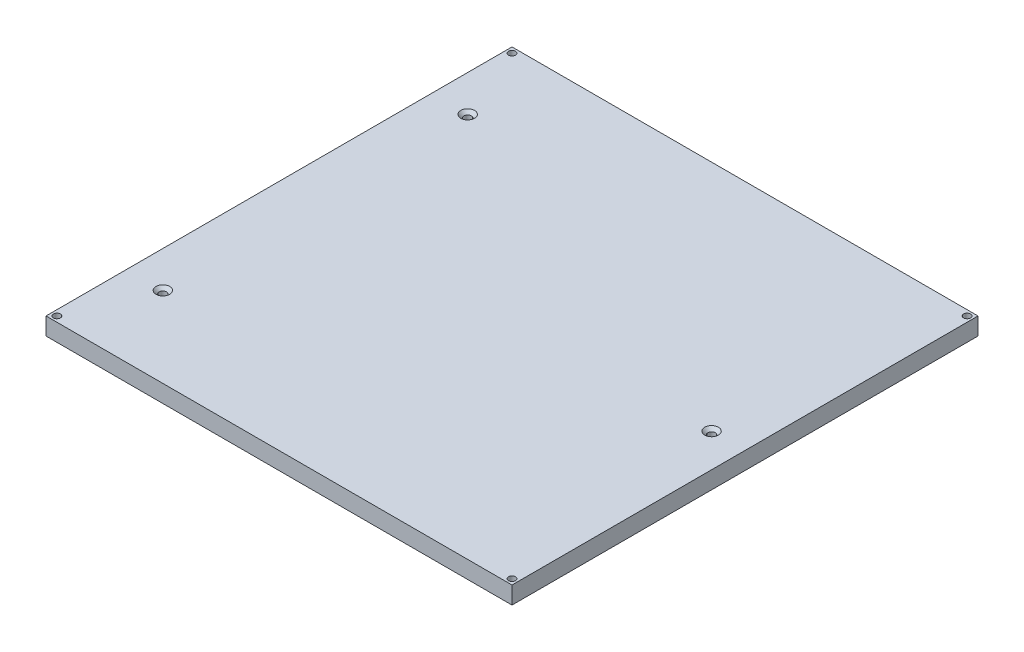
ISO-10303-21;
HEADER;
FILE_DESCRIPTION(('STEP AP214'),'2;1');
FILE_NAME('part.step','',(''),(''),'','','');
FILE_SCHEMA(('AUTOMOTIVE_DESIGN { 1 0 10303 214 1 1 1 1 }'));
ENDSEC;
DATA;
#1=APPLICATION_CONTEXT('core data for automotive mechanical design processes');
#2=APPLICATION_PROTOCOL_DEFINITION('international standard','automotive_design',2000,#1);
#3=PRODUCT_CONTEXT('',#1,'mechanical');
#4=PRODUCT('Part','Part','',(#3));
#5=PRODUCT_RELATED_PRODUCT_CATEGORY('part','',(#4));
#6=PRODUCT_DEFINITION_FORMATION('','',#4);
#7=PRODUCT_DEFINITION_CONTEXT('part definition',#1,'design');
#8=PRODUCT_DEFINITION('design','',#6,#7);
#9=PRODUCT_DEFINITION_SHAPE('','',#8);
#10=(LENGTH_UNIT() NAMED_UNIT(*) SI_UNIT(.MILLI.,.METRE.));
#11=(NAMED_UNIT(*) PLANE_ANGLE_UNIT() SI_UNIT($,.RADIAN.));
#12=(NAMED_UNIT(*) SI_UNIT($,.STERADIAN.) SOLID_ANGLE_UNIT());
#13=UNCERTAINTY_MEASURE_WITH_UNIT(LENGTH_MEASURE(1.E-05),#10,'distance_accuracy_value','');
#14=(GEOMETRIC_REPRESENTATION_CONTEXT(3) GLOBAL_UNCERTAINTY_ASSIGNED_CONTEXT((#13)) GLOBAL_UNIT_ASSIGNED_CONTEXT((#10,
#11,#12)) REPRESENTATION_CONTEXT('',''));
#15=CARTESIAN_POINT('',(0.,0.,0.));
#16=DIRECTION('',(0.,0.,1.));
#17=DIRECTION('',(1.,0.,0.));
#18=AXIS2_PLACEMENT_3D('',#15,#16,#17);
#19=CARTESIAN_POINT('',(-107.,8.,-107.));
#20=DIRECTION('',(1.,0.,0.));
#21=DIRECTION('',(0.,0.,-1.));
#22=AXIS2_PLACEMENT_3D('',#19,#20,#21);
#23=PLANE('',#22);
#24=DIRECTION('',(0.,0.,1.));
#25=VECTOR('',#24,1.);
#26=CARTESIAN_POINT('',(-107.,0.,-107.));
#27=LINE('',#26,#25);
#28=CARTESIAN_POINT('',(-107.,0.,-107.));
#29=VERTEX_POINT('',#28);
#30=CARTESIAN_POINT('',(-107.,0.,107.));
#31=VERTEX_POINT('',#30);
#32=EDGE_CURVE('E96',#29,#31,#27,.T.);
#33=ORIENTED_EDGE('',*,*,#32,.T.);
#34=DIRECTION('',(0.,-1.,0.));
#35=VECTOR('',#34,1.);
#36=CARTESIAN_POINT('',(-107.,8.,107.));
#37=LINE('',#36,#35);
#38=CARTESIAN_POINT('',(-107.,8.,107.));
#39=VERTEX_POINT('',#38);
#40=EDGE_CURVE('E11',#39,#31,#37,.T.);
#41=ORIENTED_EDGE('',*,*,#40,.F.);
#42=DIRECTION('',(0.,0.,1.));
#43=VECTOR('',#42,1.);
#44=CARTESIAN_POINT('',(-107.,8.,-107.));
#45=LINE('',#44,#43);
#46=CARTESIAN_POINT('',(-107.,8.,-107.));
#47=VERTEX_POINT('',#46);
#48=EDGE_CURVE('E84',#47,#39,#45,.T.);
#49=ORIENTED_EDGE('',*,*,#48,.F.);
#50=DIRECTION('',(0.,-1.,0.));
#51=VECTOR('',#50,1.);
#52=CARTESIAN_POINT('',(-107.,8.,-107.));
#53=LINE('',#52,#51);
#54=EDGE_CURVE('E92',#47,#29,#53,.T.);
#55=ORIENTED_EDGE('',*,*,#54,.T.);
#56=EDGE_LOOP('',(#33,#41,#49,#55));
#57=FACE_BOUND('',#56,.T.);
#58=ADVANCED_FACE('F33',(#57),#23,.F.);
#59=CARTESIAN_POINT('',(-107.,8.,107.));
#60=DIRECTION('',(0.,0.,-1.));
#61=DIRECTION('',(-1.,0.,0.));
#62=AXIS2_PLACEMENT_3D('',#59,#60,#61);
#63=PLANE('',#62);
#64=DIRECTION('',(1.,0.,0.));
#65=VECTOR('',#64,1.);
#66=CARTESIAN_POINT('',(-107.,0.,107.));
#67=LINE('',#66,#65);
#68=CARTESIAN_POINT('',(107.,0.,107.));
#69=VERTEX_POINT('',#68);
#70=EDGE_CURVE('E88',#31,#69,#67,.T.);
#71=ORIENTED_EDGE('',*,*,#70,.T.);
#72=DIRECTION('',(0.,-1.,0.));
#73=VECTOR('',#72,1.);
#74=CARTESIAN_POINT('',(107.,8.,107.));
#75=LINE('',#74,#73);
#76=CARTESIAN_POINT('',(107.,8.,107.));
#77=VERTEX_POINT('',#76);
#78=EDGE_CURVE('E41',#77,#69,#75,.T.);
#79=ORIENTED_EDGE('',*,*,#78,.F.);
#80=DIRECTION('',(1.,0.,0.));
#81=VECTOR('',#80,1.);
#82=CARTESIAN_POINT('',(-107.,8.,107.));
#83=LINE('',#82,#81);
#84=EDGE_CURVE('E79',#39,#77,#83,.T.);
#85=ORIENTED_EDGE('',*,*,#84,.F.);
#86=ORIENTED_EDGE('',*,*,#40,.T.);
#87=EDGE_LOOP('',(#71,#79,#85,#86));
#88=FACE_BOUND('',#87,.T.);
#89=ADVANCED_FACE('F87',(#88),#63,.F.);
#90=CARTESIAN_POINT('',(107.,8.,-107.));
#91=DIRECTION('',(-1.,0.,0.));
#92=DIRECTION('',(0.,0.,1.));
#93=AXIS2_PLACEMENT_3D('',#90,#91,#92);
#94=PLANE('',#93);
#95=DIRECTION('',(0.,0.,-1.));
#96=VECTOR('',#95,1.);
#97=CARTESIAN_POINT('',(107.,0.,-107.));
#98=LINE('',#97,#96);
#99=CARTESIAN_POINT('',(107.,0.,-107.));
#100=VERTEX_POINT('',#99);
#101=EDGE_CURVE('E66',#69,#100,#98,.T.);
#102=ORIENTED_EDGE('',*,*,#101,.T.);
#103=DIRECTION('',(0.,-1.,0.));
#104=VECTOR('',#103,1.);
#105=CARTESIAN_POINT('',(107.,8.,-107.));
#106=LINE('',#105,#104);
#107=CARTESIAN_POINT('',(107.,8.,-107.));
#108=VERTEX_POINT('',#107);
#109=EDGE_CURVE('E89',#108,#100,#106,.T.);
#110=ORIENTED_EDGE('',*,*,#109,.F.);
#111=DIRECTION('',(0.,0.,-1.));
#112=VECTOR('',#111,1.);
#113=CARTESIAN_POINT('',(107.,8.,-107.));
#114=LINE('',#113,#112);
#115=EDGE_CURVE('E82',#77,#108,#114,.T.);
#116=ORIENTED_EDGE('',*,*,#115,.F.);
#117=ORIENTED_EDGE('',*,*,#78,.T.);
#118=EDGE_LOOP('',(#102,#110,#116,#117));
#119=FACE_BOUND('',#118,.T.);
#120=ADVANCED_FACE('F90',(#119),#94,.F.);
#121=CARTESIAN_POINT('',(-107.,8.,-107.));
#122=DIRECTION('',(0.,0.,1.));
#123=DIRECTION('',(1.,0.,0.));
#124=AXIS2_PLACEMENT_3D('',#121,#122,#123);
#125=PLANE('',#124);
#126=DIRECTION('',(-1.,0.,0.));
#127=VECTOR('',#126,1.);
#128=CARTESIAN_POINT('',(-107.,0.,-107.));
#129=LINE('',#128,#127);
#130=EDGE_CURVE('E72',#100,#29,#129,.T.);
#131=ORIENTED_EDGE('',*,*,#130,.T.);
#132=ORIENTED_EDGE('',*,*,#54,.F.);
#133=DIRECTION('',(-1.,0.,0.));
#134=VECTOR('',#133,1.);
#135=CARTESIAN_POINT('',(-107.,8.,-107.));
#136=LINE('',#135,#134);
#137=EDGE_CURVE('E49',#108,#47,#136,.T.);
#138=ORIENTED_EDGE('',*,*,#137,.F.);
#139=ORIENTED_EDGE('',*,*,#109,.T.);
#140=EDGE_LOOP('',(#131,#132,#138,#139));
#141=FACE_BOUND('',#140,.T.);
#142=ADVANCED_FACE('F104',(#141),#125,.F.);
#143=CARTESIAN_POINT('',(0.,8.,0.));
#144=DIRECTION('',(0.,1.,0.));
#145=DIRECTION('',(0.,0.,1.));
#146=AXIS2_PLACEMENT_3D('',#143,#144,#145);
#147=PLANE('',#146);
#148=CARTESIAN_POINT('',(-90.3456842106107,8.,-70.));
#149=DIRECTION('',(0.,1.,0.));
#150=DIRECTION('',(0.,0.,1.));
#151=AXIS2_PLACEMENT_3D('',#148,#149,#150);
#152=CIRCLE('',#151,3.15);
#153=CARTESIAN_POINT('',(-90.3456842106107,8.,-66.85));
#154=VERTEX_POINT('',#153);
#155=EDGE_CURVE('E157',#154,#154,#152,.T.);
#156=ORIENTED_EDGE('',*,*,#155,.F.);
#157=EDGE_LOOP('',(#156));
#158=FACE_BOUND('',#157,.T.);
#159=CARTESIAN_POINT('',(-90.3456842106107,8.,70.));
#160=DIRECTION('',(0.,1.,0.));
#161=DIRECTION('',(0.,0.,1.));
#162=AXIS2_PLACEMENT_3D('',#159,#160,#161);
#163=CIRCLE('',#162,3.15);
#164=CARTESIAN_POINT('',(-90.3456842106107,8.,73.15));
#165=VERTEX_POINT('',#164);
#166=EDGE_CURVE('E148',#165,#165,#163,.T.);
#167=ORIENTED_EDGE('',*,*,#166,.F.);
#168=EDGE_LOOP('',(#167));
#169=FACE_BOUND('',#168,.T.);
#170=CARTESIAN_POINT('',(91.6543157895794,8.,0.));
#171=DIRECTION('',(0.,1.,0.));
#172=DIRECTION('',(0.,0.,1.));
#173=AXIS2_PLACEMENT_3D('',#170,#171,#172);
#174=CIRCLE('',#173,3.15);
#175=CARTESIAN_POINT('',(91.6543157895794,8.,3.15000000000004));
#176=VERTEX_POINT('',#175);
#177=EDGE_CURVE('E139',#176,#176,#174,.T.);
#178=ORIENTED_EDGE('',*,*,#177,.F.);
#179=EDGE_LOOP('',(#178));
#180=FACE_BOUND('',#179,.T.);
#181=CARTESIAN_POINT('',(-104.5,8.,104.5));
#182=DIRECTION('',(0.,1.,0.));
#183=DIRECTION('',(0.,0.,1.));
#184=AXIS2_PLACEMENT_3D('',#181,#182,#183);
#185=CIRCLE('',#184,1.6);
#186=CARTESIAN_POINT('',(-104.5,8.,106.1));
#187=VERTEX_POINT('',#186);
#188=EDGE_CURVE('E130',#187,#187,#185,.T.);
#189=ORIENTED_EDGE('',*,*,#188,.F.);
#190=EDGE_LOOP('',(#189));
#191=FACE_BOUND('',#190,.T.);
#192=CARTESIAN_POINT('',(-104.5,8.,-104.5));
#193=DIRECTION('',(0.,1.,0.));
#194=DIRECTION('',(0.,0.,1.));
#195=AXIS2_PLACEMENT_3D('',#192,#193,#194);
#196=CIRCLE('',#195,1.6);
#197=CARTESIAN_POINT('',(-104.5,8.,-102.9));
#198=VERTEX_POINT('',#197);
#199=EDGE_CURVE('E124',#198,#198,#196,.T.);
#200=ORIENTED_EDGE('',*,*,#199,.F.);
#201=EDGE_LOOP('',(#200));
#202=FACE_BOUND('',#201,.T.);
#203=CARTESIAN_POINT('',(104.5,8.,-104.5));
#204=DIRECTION('',(0.,1.,0.));
#205=DIRECTION('',(0.,0.,1.));
#206=AXIS2_PLACEMENT_3D('',#203,#204,#205);
#207=CIRCLE('',#206,1.6);
#208=CARTESIAN_POINT('',(104.5,8.,-102.9));
#209=VERTEX_POINT('',#208);
#210=EDGE_CURVE('E118',#209,#209,#207,.T.);
#211=ORIENTED_EDGE('',*,*,#210,.F.);
#212=EDGE_LOOP('',(#211));
#213=FACE_BOUND('',#212,.T.);
#214=CARTESIAN_POINT('',(104.5,8.,104.5));
#215=DIRECTION('',(0.,1.,0.));
#216=DIRECTION('',(0.,0.,1.));
#217=AXIS2_PLACEMENT_3D('',#214,#215,#216);
#218=CIRCLE('',#217,1.6);
#219=CARTESIAN_POINT('',(104.5,8.,106.1));
#220=VERTEX_POINT('',#219);
#221=EDGE_CURVE('E112',#220,#220,#218,.T.);
#222=ORIENTED_EDGE('',*,*,#221,.F.);
#223=EDGE_LOOP('',(#222));
#224=FACE_BOUND('',#223,.T.);
#225=ORIENTED_EDGE('',*,*,#48,.T.);
#226=ORIENTED_EDGE('',*,*,#84,.T.);
#227=ORIENTED_EDGE('',*,*,#115,.T.);
#228=ORIENTED_EDGE('',*,*,#137,.T.);
#229=EDGE_LOOP('',(#225,#226,#227,#228));
#230=FACE_BOUND('',#229,.T.);
#231=ADVANCED_FACE('F80',(#158,#169,#180,#191,#202,#213,#224,#230),#147,.T.);
#232=CARTESIAN_POINT('',(0.,0.,0.));
#233=DIRECTION('',(0.,1.,0.));
#234=DIRECTION('',(0.,0.,1.));
#235=AXIS2_PLACEMENT_3D('',#232,#233,#234);
#236=PLANE('',#235);
#237=CARTESIAN_POINT('',(-90.3456842106107,0.,-70.));
#238=DIRECTION('',(0.,1.,0.));
#239=DIRECTION('',(0.,0.,1.));
#240=AXIS2_PLACEMENT_3D('',#237,#238,#239);
#241=CIRCLE('',#240,1.69999999999999);
#242=CARTESIAN_POINT('',(-90.3456842106107,0.,-68.3));
#243=VERTEX_POINT('',#242);
#244=EDGE_CURVE('E151',#243,#243,#241,.T.);
#245=ORIENTED_EDGE('',*,*,#244,.T.);
#246=EDGE_LOOP('',(#245));
#247=FACE_BOUND('',#246,.T.);
#248=CARTESIAN_POINT('',(-90.3456842106107,0.,70.));
#249=DIRECTION('',(0.,1.,0.));
#250=DIRECTION('',(0.,0.,1.));
#251=AXIS2_PLACEMENT_3D('',#248,#249,#250);
#252=CIRCLE('',#251,1.69999999999999);
#253=CARTESIAN_POINT('',(-90.3456842106107,0.,71.7));
#254=VERTEX_POINT('',#253);
#255=EDGE_CURVE('E142',#254,#254,#252,.T.);
#256=ORIENTED_EDGE('',*,*,#255,.T.);
#257=EDGE_LOOP('',(#256));
#258=FACE_BOUND('',#257,.T.);
#259=CARTESIAN_POINT('',(91.6543157895794,0.,0.));
#260=DIRECTION('',(0.,1.,0.));
#261=DIRECTION('',(0.,0.,1.));
#262=AXIS2_PLACEMENT_3D('',#259,#260,#261);
#263=CIRCLE('',#262,1.69999999999999);
#264=CARTESIAN_POINT('',(91.6543157895794,0.,1.70000000000003));
#265=VERTEX_POINT('',#264);
#266=EDGE_CURVE('E133',#265,#265,#263,.T.);
#267=ORIENTED_EDGE('',*,*,#266,.T.);
#268=EDGE_LOOP('',(#267));
#269=FACE_BOUND('',#268,.T.);
#270=CARTESIAN_POINT('',(-104.5,0.,104.5));
#271=DIRECTION('',(0.,1.,0.));
#272=DIRECTION('',(0.,0.,1.));
#273=AXIS2_PLACEMENT_3D('',#270,#271,#272);
#274=CIRCLE('',#273,1.6);
#275=CARTESIAN_POINT('',(-104.5,0.,106.1));
#276=VERTEX_POINT('',#275);
#277=EDGE_CURVE('E127',#276,#276,#274,.T.);
#278=ORIENTED_EDGE('',*,*,#277,.T.);
#279=EDGE_LOOP('',(#278));
#280=FACE_BOUND('',#279,.T.);
#281=CARTESIAN_POINT('',(-104.5,0.,-104.5));
#282=DIRECTION('',(0.,1.,0.));
#283=DIRECTION('',(0.,0.,1.));
#284=AXIS2_PLACEMENT_3D('',#281,#282,#283);
#285=CIRCLE('',#284,1.6);
#286=CARTESIAN_POINT('',(-104.5,0.,-102.9));
#287=VERTEX_POINT('',#286);
#288=EDGE_CURVE('E121',#287,#287,#285,.T.);
#289=ORIENTED_EDGE('',*,*,#288,.T.);
#290=EDGE_LOOP('',(#289));
#291=FACE_BOUND('',#290,.T.);
#292=CARTESIAN_POINT('',(104.5,0.,-104.5));
#293=DIRECTION('',(0.,1.,0.));
#294=DIRECTION('',(0.,0.,1.));
#295=AXIS2_PLACEMENT_3D('',#292,#293,#294);
#296=CIRCLE('',#295,1.6);
#297=CARTESIAN_POINT('',(104.5,0.,-102.9));
#298=VERTEX_POINT('',#297);
#299=EDGE_CURVE('E115',#298,#298,#296,.T.);
#300=ORIENTED_EDGE('',*,*,#299,.T.);
#301=EDGE_LOOP('',(#300));
#302=FACE_BOUND('',#301,.T.);
#303=CARTESIAN_POINT('',(104.5,0.,104.5));
#304=DIRECTION('',(0.,1.,0.));
#305=DIRECTION('',(0.,0.,1.));
#306=AXIS2_PLACEMENT_3D('',#303,#304,#305);
#307=CIRCLE('',#306,1.6);
#308=CARTESIAN_POINT('',(104.5,0.,106.1));
#309=VERTEX_POINT('',#308);
#310=EDGE_CURVE('E99',#309,#309,#307,.T.);
#311=ORIENTED_EDGE('',*,*,#310,.T.);
#312=EDGE_LOOP('',(#311));
#313=FACE_BOUND('',#312,.T.);
#314=ORIENTED_EDGE('',*,*,#32,.F.);
#315=ORIENTED_EDGE('',*,*,#130,.F.);
#316=ORIENTED_EDGE('',*,*,#101,.F.);
#317=ORIENTED_EDGE('',*,*,#70,.F.);
#318=EDGE_LOOP('',(#314,#315,#316,#317));
#319=FACE_BOUND('',#318,.T.);
#320=ADVANCED_FACE('F107',(#247,#258,#269,#280,#291,#302,#313,#319),#236,.F.);
#321=CARTESIAN_POINT('',(104.5,8.,104.5));
#322=DIRECTION('',(0.,1.,0.));
#323=DIRECTION('',(0.,0.,1.));
#324=AXIS2_PLACEMENT_3D('',#321,#322,#323);
#325=CYLINDRICAL_SURFACE('',#324,1.6);
#326=ORIENTED_EDGE('',*,*,#310,.F.);
#327=EDGE_LOOP('',(#326));
#328=FACE_BOUND('',#327,.T.);
#329=ORIENTED_EDGE('',*,*,#221,.T.);
#330=EDGE_LOOP('',(#329));
#331=FACE_BOUND('',#330,.T.);
#332=ADVANCED_FACE('F178',(#328,#331),#325,.F.);
#333=CARTESIAN_POINT('',(104.5,8.,-104.5));
#334=DIRECTION('',(0.,1.,0.));
#335=DIRECTION('',(0.,0.,1.));
#336=AXIS2_PLACEMENT_3D('',#333,#334,#335);
#337=CYLINDRICAL_SURFACE('',#336,1.6);
#338=ORIENTED_EDGE('',*,*,#299,.F.);
#339=EDGE_LOOP('',(#338));
#340=FACE_BOUND('',#339,.T.);
#341=ORIENTED_EDGE('',*,*,#210,.T.);
#342=EDGE_LOOP('',(#341));
#343=FACE_BOUND('',#342,.T.);
#344=ADVANCED_FACE('F180',(#340,#343),#337,.F.);
#345=CARTESIAN_POINT('',(-104.5,8.,-104.5));
#346=DIRECTION('',(0.,1.,0.));
#347=DIRECTION('',(0.,0.,1.));
#348=AXIS2_PLACEMENT_3D('',#345,#346,#347);
#349=CYLINDRICAL_SURFACE('',#348,1.6);
#350=ORIENTED_EDGE('',*,*,#288,.F.);
#351=EDGE_LOOP('',(#350));
#352=FACE_BOUND('',#351,.T.);
#353=ORIENTED_EDGE('',*,*,#199,.T.);
#354=EDGE_LOOP('',(#353));
#355=FACE_BOUND('',#354,.T.);
#356=ADVANCED_FACE('F187',(#352,#355),#349,.F.);
#357=CARTESIAN_POINT('',(-104.5,8.,104.5));
#358=DIRECTION('',(0.,1.,0.));
#359=DIRECTION('',(0.,0.,1.));
#360=AXIS2_PLACEMENT_3D('',#357,#358,#359);
#361=CYLINDRICAL_SURFACE('',#360,1.6);
#362=ORIENTED_EDGE('',*,*,#277,.F.);
#363=EDGE_LOOP('',(#362));
#364=FACE_BOUND('',#363,.T.);
#365=ORIENTED_EDGE('',*,*,#188,.T.);
#366=EDGE_LOOP('',(#365));
#367=FACE_BOUND('',#366,.T.);
#368=ADVANCED_FACE('F228',(#364,#367),#361,.F.);
#369=CARTESIAN_POINT('',(91.6543157895794,8.,0.));
#370=DIRECTION('',(0.,1.,0.));
#371=DIRECTION('',(0.,0.,1.));
#372=AXIS2_PLACEMENT_3D('',#369,#370,#371);
#373=CYLINDRICAL_SURFACE('',#372,1.69999999999999);
#374=ORIENTED_EDGE('',*,*,#266,.F.);
#375=EDGE_LOOP('',(#374));
#376=FACE_BOUND('',#375,.T.);
#377=CARTESIAN_POINT('',(91.6543157895794,6.55,0.));
#378=DIRECTION('',(0.,1.,0.));
#379=DIRECTION('',(0.,0.,1.));
#380=AXIS2_PLACEMENT_3D('',#377,#378,#379);
#381=CIRCLE('',#380,1.69999999999999);
#382=CARTESIAN_POINT('',(91.6543157895794,6.55,1.70000000000003));
#383=VERTEX_POINT('',#382);
#384=EDGE_CURVE('E136',#383,#383,#381,.T.);
#385=ORIENTED_EDGE('',*,*,#384,.T.);
#386=EDGE_LOOP('',(#385));
#387=FACE_BOUND('',#386,.T.);
#388=ADVANCED_FACE('F222',(#376,#387),#373,.F.);
#389=CARTESIAN_POINT('',(91.6543157895794,8.,0.));
#390=DIRECTION('',(0.,1.,0.));
#391=DIRECTION('',(0.,0.,1.));
#392=AXIS2_PLACEMENT_3D('',#389,#390,#391);
#393=CONICAL_SURFACE('',#392,3.15,0.785398163397451);
#394=ORIENTED_EDGE('',*,*,#384,.F.);
#395=EDGE_LOOP('',(#394));
#396=FACE_BOUND('',#395,.T.);
#397=ORIENTED_EDGE('',*,*,#177,.T.);
#398=EDGE_LOOP('',(#397));
#399=FACE_BOUND('',#398,.T.);
#400=ADVANCED_FACE('F227',(#396,#399),#393,.F.);
#401=CARTESIAN_POINT('',(-90.3456842106107,8.,70.));
#402=DIRECTION('',(0.,1.,0.));
#403=DIRECTION('',(0.,0.,1.));
#404=AXIS2_PLACEMENT_3D('',#401,#402,#403);
#405=CYLINDRICAL_SURFACE('',#404,1.69999999999999);
#406=ORIENTED_EDGE('',*,*,#255,.F.);
#407=EDGE_LOOP('',(#406));
#408=FACE_BOUND('',#407,.T.);
#409=CARTESIAN_POINT('',(-90.3456842106107,6.55,70.));
#410=DIRECTION('',(0.,1.,0.));
#411=DIRECTION('',(0.,0.,1.));
#412=AXIS2_PLACEMENT_3D('',#409,#410,#411);
#413=CIRCLE('',#412,1.69999999999999);
#414=CARTESIAN_POINT('',(-90.3456842106107,6.55,71.7));
#415=VERTEX_POINT('',#414);
#416=EDGE_CURVE('E145',#415,#415,#413,.T.);
#417=ORIENTED_EDGE('',*,*,#416,.T.);
#418=EDGE_LOOP('',(#417));
#419=FACE_BOUND('',#418,.T.);
#420=ADVANCED_FACE('F240',(#408,#419),#405,.F.);
#421=CARTESIAN_POINT('',(-90.3456842106107,8.,70.));
#422=DIRECTION('',(0.,1.,0.));
#423=DIRECTION('',(0.,0.,1.));
#424=AXIS2_PLACEMENT_3D('',#421,#422,#423);
#425=CONICAL_SURFACE('',#424,3.15,0.785398163397451);
#426=ORIENTED_EDGE('',*,*,#416,.F.);
#427=EDGE_LOOP('',(#426));
#428=FACE_BOUND('',#427,.T.);
#429=ORIENTED_EDGE('',*,*,#166,.T.);
#430=EDGE_LOOP('',(#429));
#431=FACE_BOUND('',#430,.T.);
#432=ADVANCED_FACE('F250',(#428,#431),#425,.F.);
#433=CARTESIAN_POINT('',(-90.3456842106107,8.,-70.));
#434=DIRECTION('',(0.,1.,0.));
#435=DIRECTION('',(0.,0.,1.));
#436=AXIS2_PLACEMENT_3D('',#433,#434,#435);
#437=CYLINDRICAL_SURFACE('',#436,1.69999999999999);
#438=ORIENTED_EDGE('',*,*,#244,.F.);
#439=EDGE_LOOP('',(#438));
#440=FACE_BOUND('',#439,.T.);
#441=CARTESIAN_POINT('',(-90.3456842106107,6.55,-70.));
#442=DIRECTION('',(0.,1.,0.));
#443=DIRECTION('',(0.,0.,1.));
#444=AXIS2_PLACEMENT_3D('',#441,#442,#443);
#445=CIRCLE('',#444,1.69999999999999);
#446=CARTESIAN_POINT('',(-90.3456842106107,6.55,-68.3));
#447=VERTEX_POINT('',#446);
#448=EDGE_CURVE('E154',#447,#447,#445,.T.);
#449=ORIENTED_EDGE('',*,*,#448,.T.);
#450=EDGE_LOOP('',(#449));
#451=FACE_BOUND('',#450,.T.);
#452=ADVANCED_FACE('F260',(#440,#451),#437,.F.);
#453=CARTESIAN_POINT('',(-90.3456842106107,8.,-70.));
#454=DIRECTION('',(0.,1.,0.));
#455=DIRECTION('',(0.,0.,1.));
#456=AXIS2_PLACEMENT_3D('',#453,#454,#455);
#457=CONICAL_SURFACE('',#456,3.15,0.785398163397451);
#458=ORIENTED_EDGE('',*,*,#448,.F.);
#459=EDGE_LOOP('',(#458));
#460=FACE_BOUND('',#459,.T.);
#461=ORIENTED_EDGE('',*,*,#155,.T.);
#462=EDGE_LOOP('',(#461));
#463=FACE_BOUND('',#462,.T.);
#464=ADVANCED_FACE('F161',(#460,#463),#457,.F.);
#465=CLOSED_SHELL('',(#58,#89,#120,#142,#231,#320,#332,#344,#356,#368,#388,#400,#420,#432,#452,#464));
#466=MANIFOLD_SOLID_BREP('B2',#465);
#467=ADVANCED_BREP_SHAPE_REPRESENTATION('',(#18,#466),#14);
#468=SHAPE_DEFINITION_REPRESENTATION(#9,#467);
ENDSEC;
END-ISO-10303-21;
